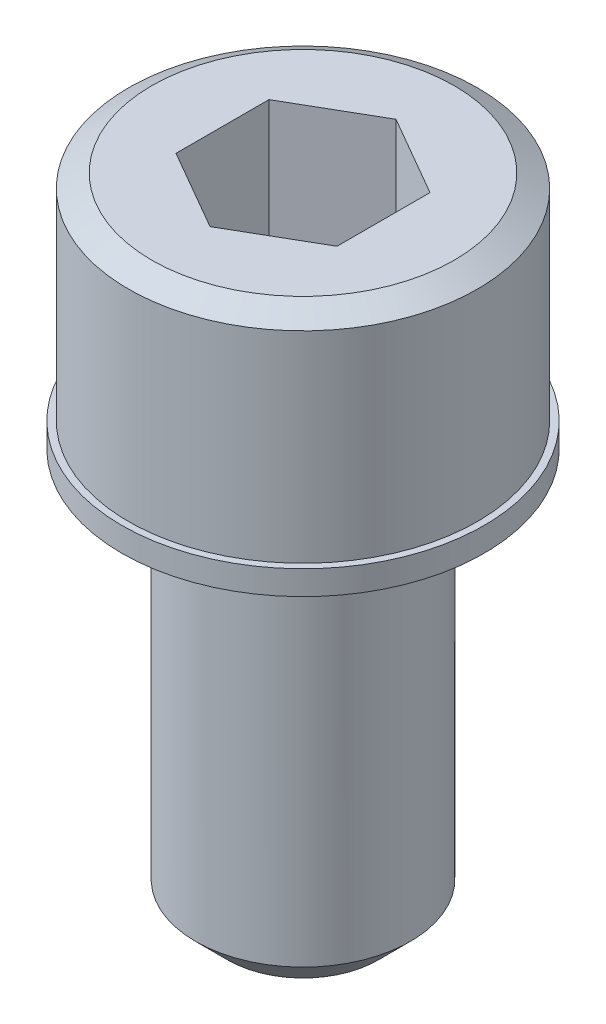
ISO-10303-21;
HEADER;
FILE_DESCRIPTION(('STEP AP214'),'2;1');
FILE_NAME('part.step','',(''),(''),'','','');
FILE_SCHEMA(('AUTOMOTIVE_DESIGN { 1 0 10303 214 1 1 1 1 }'));
ENDSEC;
DATA;
#1=APPLICATION_CONTEXT('core data for automotive mechanical design processes');
#2=APPLICATION_PROTOCOL_DEFINITION('international standard','automotive_design',2000,#1);
#3=PRODUCT_CONTEXT('',#1,'mechanical');
#4=PRODUCT('Part','Part','',(#3));
#5=PRODUCT_RELATED_PRODUCT_CATEGORY('part','',(#4));
#6=PRODUCT_DEFINITION_FORMATION('','',#4);
#7=PRODUCT_DEFINITION_CONTEXT('part definition',#1,'design');
#8=PRODUCT_DEFINITION('design','',#6,#7);
#9=PRODUCT_DEFINITION_SHAPE('','',#8);
#10=(LENGTH_UNIT() NAMED_UNIT(*) SI_UNIT(.MILLI.,.METRE.));
#11=(NAMED_UNIT(*) PLANE_ANGLE_UNIT() SI_UNIT($,.RADIAN.));
#12=(NAMED_UNIT(*) SI_UNIT($,.STERADIAN.) SOLID_ANGLE_UNIT());
#13=UNCERTAINTY_MEASURE_WITH_UNIT(LENGTH_MEASURE(1.E-05),#10,'distance_accuracy_value','');
#14=(GEOMETRIC_REPRESENTATION_CONTEXT(3) GLOBAL_UNCERTAINTY_ASSIGNED_CONTEXT((#13)) GLOBAL_UNIT_ASSIGNED_CONTEXT((#10,
#11,#12)) REPRESENTATION_CONTEXT('',''));
#15=CARTESIAN_POINT('',(0.,0.,0.));
#16=DIRECTION('',(0.,0.,1.));
#17=DIRECTION('',(1.,0.,0.));
#18=AXIS2_PLACEMENT_3D('',#15,#16,#17);
#19=CARTESIAN_POINT('',(0.,2.,0.));
#20=DIRECTION('',(0.,1.,0.));
#21=DIRECTION('',(0.,0.,1.));
#22=AXIS2_PLACEMENT_3D('',#19,#20,#21);
#23=PLANE('',#22);
#24=DIRECTION('',(0.866025403784429,0.,0.500000000000017));
#25=VECTOR('',#24,1.);
#26=CARTESIAN_POINT('',(-3.,2.,1.732050807569));
#27=LINE('',#26,#25);
#28=CARTESIAN_POINT('',(-3.,2.,1.732050807569));
#29=VERTEX_POINT('',#28);
#30=CARTESIAN_POINT('',(0.,2.,3.46410161513799));
#31=VERTEX_POINT('',#30);
#32=EDGE_CURVE('E80',#29,#31,#27,.T.);
#33=ORIENTED_EDGE('',*,*,#32,.T.);
#34=DIRECTION('',(0.866025403784429,0.,-0.500000000000017));
#35=VECTOR('',#34,1.);
#36=CARTESIAN_POINT('',(0.,2.,3.464101615138));
#37=LINE('',#36,#35);
#38=CARTESIAN_POINT('',(3.,2.,1.73205080756902));
#39=VERTEX_POINT('',#38);
#40=EDGE_CURVE('E77',#31,#39,#37,.T.);
#41=ORIENTED_EDGE('',*,*,#40,.T.);
#42=DIRECTION('',(0.,0.,-1.));
#43=VECTOR('',#42,1.);
#44=CARTESIAN_POINT('',(3.,2.,1.732050807569));
#45=LINE('',#44,#43);
#46=CARTESIAN_POINT('',(3.,2.,-1.732050807569));
#47=VERTEX_POINT('',#46);
#48=EDGE_CURVE('E74',#39,#47,#45,.T.);
#49=ORIENTED_EDGE('',*,*,#48,.T.);
#50=DIRECTION('',(-0.866025403784429,0.,-0.500000000000017));
#51=VECTOR('',#50,1.);
#52=CARTESIAN_POINT('',(3.,2.,-1.732050807569));
#53=LINE('',#52,#51);
#54=CARTESIAN_POINT('',(0.,2.,-3.46410161513798));
#55=VERTEX_POINT('',#54);
#56=EDGE_CURVE('E97',#47,#55,#53,.T.);
#57=ORIENTED_EDGE('',*,*,#56,.T.);
#58=DIRECTION('',(-0.866025403784429,0.,0.500000000000017));
#59=VECTOR('',#58,1.);
#60=CARTESIAN_POINT('',(0.,2.,-3.464101615138));
#61=LINE('',#60,#59);
#62=CARTESIAN_POINT('',(-3.,2.,-1.73205080756902));
#63=VERTEX_POINT('',#62);
#64=EDGE_CURVE('E358',#55,#63,#61,.T.);
#65=ORIENTED_EDGE('',*,*,#64,.T.);
#66=DIRECTION('',(0.,0.,1.));
#67=VECTOR('',#66,1.);
#68=CARTESIAN_POINT('',(-3.,2.,-1.732050807569));
#69=LINE('',#68,#67);
#70=EDGE_CURVE('E365',#63,#29,#69,.T.);
#71=ORIENTED_EDGE('',*,*,#70,.T.);
#72=EDGE_LOOP('',(#33,#41,#49,#57,#65,#71));
#73=FACE_BOUND('',#72,.T.);
#74=ADVANCED_FACE('F16',(#73),#23,.T.);
#75=CARTESIAN_POINT('',(0.,8.,3.464101615138));
#76=DIRECTION('',(0.500000000000017,0.,0.866025403784429));
#77=DIRECTION('',(0.866025403784429,0.,-0.500000000000017));
#78=AXIS2_PLACEMENT_3D('',#75,#76,#77);
#79=PLANE('',#78);
#80=ORIENTED_EDGE('',*,*,#40,.F.);
#81=DIRECTION('',(0.,1.,0.));
#82=VECTOR('',#81,1.);
#83=CARTESIAN_POINT('',(0.,8.,3.46410161513797));
#84=LINE('',#83,#82);
#85=CARTESIAN_POINT('',(0.,8.,3.46410161513799));
#86=VERTEX_POINT('',#85);
#87=EDGE_CURVE('E371',#31,#86,#84,.T.);
#88=ORIENTED_EDGE('',*,*,#87,.T.);
#89=DIRECTION('',(0.866025403784423,0.,-0.500000000000027));
#90=VECTOR('',#89,1.);
#91=CARTESIAN_POINT('',(0.,8.,3.464101615138));
#92=LINE('',#91,#90);
#93=CARTESIAN_POINT('',(3.,8.,1.73205080756902));
#94=VERTEX_POINT('',#93);
#95=EDGE_CURVE('E88',#86,#94,#92,.T.);
#96=ORIENTED_EDGE('',*,*,#95,.T.);
#97=DIRECTION('',(0.,1.,0.));
#98=VECTOR('',#97,1.);
#99=CARTESIAN_POINT('',(3.,8.,1.732050807569));
#100=LINE('',#99,#98);
#101=EDGE_CURVE('E83',#94,#39,#100,.F.);
#102=ORIENTED_EDGE('',*,*,#101,.T.);
#103=EDGE_LOOP('',(#80,#88,#96,#102));
#104=FACE_BOUND('',#103,.T.);
#105=ADVANCED_FACE('F86',(#104),#79,.F.);
#106=CARTESIAN_POINT('',(3.,8.,1.732050807569));
#107=DIRECTION('',(1.,0.,0.));
#108=DIRECTION('',(0.,0.,-1.));
#109=AXIS2_PLACEMENT_3D('',#106,#107,#108);
#110=PLANE('',#109);
#111=ORIENTED_EDGE('',*,*,#48,.F.);
#112=ORIENTED_EDGE('',*,*,#101,.F.);
#113=DIRECTION('',(0.,0.,-1.));
#114=VECTOR('',#113,1.);
#115=CARTESIAN_POINT('',(3.,8.,0.));
#116=LINE('',#115,#114);
#117=CARTESIAN_POINT('',(3.,8.,-1.732050807569));
#118=VERTEX_POINT('',#117);
#119=EDGE_CURVE('E374',#94,#118,#116,.T.);
#120=ORIENTED_EDGE('',*,*,#119,.T.);
#121=DIRECTION('',(0.,1.,0.));
#122=VECTOR('',#121,1.);
#123=CARTESIAN_POINT('',(3.,8.,-1.732050807569));
#124=LINE('',#123,#122);
#125=EDGE_CURVE('E94',#118,#47,#124,.F.);
#126=ORIENTED_EDGE('',*,*,#125,.T.);
#127=EDGE_LOOP('',(#111,#112,#120,#126));
#128=FACE_BOUND('',#127,.T.);
#129=ADVANCED_FACE('F92',(#128),#110,.F.);
#130=CARTESIAN_POINT('',(3.,8.,-1.732050807569));
#131=DIRECTION('',(0.500000000000017,0.,-0.866025403784429));
#132=DIRECTION('',(-0.866025403784429,0.,-0.500000000000017));
#133=AXIS2_PLACEMENT_3D('',#130,#131,#132);
#134=PLANE('',#133);
#135=ORIENTED_EDGE('',*,*,#56,.F.);
#136=ORIENTED_EDGE('',*,*,#125,.F.);
#137=DIRECTION('',(-0.866025403784423,0.,-0.500000000000027));
#138=VECTOR('',#137,1.);
#139=CARTESIAN_POINT('',(3.,8.,-1.732050807569));
#140=LINE('',#139,#138);
#141=CARTESIAN_POINT('',(0.,8.,-3.46410161513798));
#142=VERTEX_POINT('',#141);
#143=EDGE_CURVE('E376',#118,#142,#140,.T.);
#144=ORIENTED_EDGE('',*,*,#143,.T.);
#145=DIRECTION('',(0.,1.,0.));
#146=VECTOR('',#145,1.);
#147=CARTESIAN_POINT('',(0.,8.,-3.464101615138));
#148=LINE('',#147,#146);
#149=EDGE_CURVE('E356',#142,#55,#148,.F.);
#150=ORIENTED_EDGE('',*,*,#149,.T.);
#151=EDGE_LOOP('',(#135,#136,#144,#150));
#152=FACE_BOUND('',#151,.T.);
#153=ADVANCED_FACE('F299',(#152),#134,.F.);
#154=CARTESIAN_POINT('',(0.,8.,-3.464101615138));
#155=DIRECTION('',(-0.500000000000017,0.,-0.866025403784429));
#156=DIRECTION('',(-0.866025403784429,0.,0.500000000000017));
#157=AXIS2_PLACEMENT_3D('',#154,#155,#156);
#158=PLANE('',#157);
#159=ORIENTED_EDGE('',*,*,#64,.F.);
#160=ORIENTED_EDGE('',*,*,#149,.F.);
#161=DIRECTION('',(-0.866025403784423,0.,0.500000000000027));
#162=VECTOR('',#161,1.);
#163=CARTESIAN_POINT('',(0.,8.,-3.464101615138));
#164=LINE('',#163,#162);
#165=CARTESIAN_POINT('',(-3.,8.,-1.73205080756902));
#166=VERTEX_POINT('',#165);
#167=EDGE_CURVE('E378',#142,#166,#164,.T.);
#168=ORIENTED_EDGE('',*,*,#167,.T.);
#169=DIRECTION('',(0.,1.,0.));
#170=VECTOR('',#169,1.);
#171=CARTESIAN_POINT('',(-3.,8.,-1.732050807569));
#172=LINE('',#171,#170);
#173=EDGE_CURVE('E362',#166,#63,#172,.F.);
#174=ORIENTED_EDGE('',*,*,#173,.T.);
#175=EDGE_LOOP('',(#159,#160,#168,#174));
#176=FACE_BOUND('',#175,.T.);
#177=ADVANCED_FACE('F290',(#176),#158,.F.);
#178=CARTESIAN_POINT('',(-3.,8.,-1.732050807569));
#179=DIRECTION('',(-1.,0.,0.));
#180=DIRECTION('',(0.,0.,1.));
#181=AXIS2_PLACEMENT_3D('',#178,#179,#180);
#182=PLANE('',#181);
#183=ORIENTED_EDGE('',*,*,#70,.F.);
#184=ORIENTED_EDGE('',*,*,#173,.F.);
#185=DIRECTION('',(0.,0.,-1.));
#186=VECTOR('',#185,1.);
#187=CARTESIAN_POINT('',(-3.,8.,0.));
#188=LINE('',#187,#186);
#189=CARTESIAN_POINT('',(-3.,8.,1.732050807569));
#190=VERTEX_POINT('',#189);
#191=EDGE_CURVE('E380',#166,#190,#188,.F.);
#192=ORIENTED_EDGE('',*,*,#191,.T.);
#193=DIRECTION('',(0.,1.,0.));
#194=VECTOR('',#193,1.);
#195=CARTESIAN_POINT('',(-3.,8.,1.732050807569));
#196=LINE('',#195,#194);
#197=EDGE_CURVE('E367',#190,#29,#196,.F.);
#198=ORIENTED_EDGE('',*,*,#197,.T.);
#199=EDGE_LOOP('',(#183,#184,#192,#198));
#200=FACE_BOUND('',#199,.T.);
#201=ADVANCED_FACE('F281',(#200),#182,.F.);
#202=CARTESIAN_POINT('',(-3.,8.,1.732050807569));
#203=DIRECTION('',(-0.500000000000017,0.,0.866025403784429));
#204=DIRECTION('',(0.866025403784429,0.,0.500000000000017));
#205=AXIS2_PLACEMENT_3D('',#202,#203,#204);
#206=PLANE('',#205);
#207=ORIENTED_EDGE('',*,*,#32,.F.);
#208=ORIENTED_EDGE('',*,*,#197,.F.);
#209=DIRECTION('',(0.866025403784423,0.,0.500000000000027));
#210=VECTOR('',#209,1.);
#211=CARTESIAN_POINT('',(-3.,8.,1.732050807569));
#212=LINE('',#211,#210);
#213=EDGE_CURVE('E123',#190,#86,#212,.T.);
#214=ORIENTED_EDGE('',*,*,#213,.T.);
#215=ORIENTED_EDGE('',*,*,#87,.F.);
#216=EDGE_LOOP('',(#207,#208,#214,#215));
#217=FACE_BOUND('',#216,.T.);
#218=ADVANCED_FACE('F272',(#217),#206,.F.);
#219=CARTESIAN_POINT('',(0.,8.,0.));
#220=DIRECTION('',(0.,-1.,0.));
#221=DIRECTION('',(0.,0.,-1.));
#222=AXIS2_PLACEMENT_3D('',#219,#220,#221);
#223=PLANE('',#222);
#224=ORIENTED_EDGE('',*,*,#191,.F.);
#225=ORIENTED_EDGE('',*,*,#167,.F.);
#226=ORIENTED_EDGE('',*,*,#143,.F.);
#227=ORIENTED_EDGE('',*,*,#119,.F.);
#228=ORIENTED_EDGE('',*,*,#95,.F.);
#229=ORIENTED_EDGE('',*,*,#213,.F.);
#230=EDGE_LOOP('',(#224,#225,#226,#227,#228,#229));
#231=FACE_BOUND('',#230,.T.);
#232=CARTESIAN_POINT('',(0.,7.99999999998136,0.));
#233=DIRECTION('',(0.,-1.,0.));
#234=DIRECTION('',(0.,0.,-1.));
#235=AXIS2_PLACEMENT_3D('',#232,#233,#234);
#236=CIRCLE('',#235,5.63397459615089);
#237=CARTESIAN_POINT('',(0.,7.99999999998136,-5.63397459615089));
#238=VERTEX_POINT('',#237);
#239=EDGE_CURVE('E121',#238,#238,#236,.T.);
#240=ORIENTED_EDGE('',*,*,#239,.F.);
#241=EDGE_LOOP('',(#240));
#242=FACE_BOUND('',#241,.T.);
#243=ADVANCED_FACE('F263',(#231,#242),#223,.F.);
#244=CARTESIAN_POINT('',(0.,7.49999999993634,0.));
#245=DIRECTION('',(0.,-1.,0.));
#246=DIRECTION('',(0.,0.,-1.));
#247=AXIS2_PLACEMENT_3D('',#244,#245,#246);
#248=CONICAL_SURFACE('',#247,6.50000000001683,1.04719755119836);
#249=ORIENTED_EDGE('',*,*,#239,.T.);
#250=EDGE_LOOP('',(#249));
#251=FACE_BOUND('',#250,.T.);
#252=CARTESIAN_POINT('',(0.,7.5,0.));
#253=DIRECTION('',(0.,-1.,0.));
#254=DIRECTION('',(0.,0.,-1.));
#255=AXIS2_PLACEMENT_3D('',#252,#253,#254);
#256=CIRCLE('',#255,6.5);
#257=CARTESIAN_POINT('',(0.,7.5,-6.5));
#258=VERTEX_POINT('',#257);
#259=EDGE_CURVE('E120',#258,#258,#256,.T.);
#260=ORIENTED_EDGE('',*,*,#259,.F.);
#261=EDGE_LOOP('',(#260));
#262=FACE_BOUND('',#261,.T.);
#263=ADVANCED_FACE('F254',(#251,#262),#248,.T.);
#264=CARTESIAN_POINT('',(0.,9.2,0.));
#265=DIRECTION('',(0.,-1.,0.));
#266=DIRECTION('',(0.,0.,-1.));
#267=AXIS2_PLACEMENT_3D('',#264,#265,#266);
#268=CYLINDRICAL_SURFACE('',#267,6.5);
#269=ORIENTED_EDGE('',*,*,#259,.T.);
#270=EDGE_LOOP('',(#269));
#271=FACE_BOUND('',#270,.T.);
#272=CARTESIAN_POINT('',(0.,0.,0.));
#273=DIRECTION('',(0.,-1.,0.));
#274=DIRECTION('',(0.,0.,-1.));
#275=AXIS2_PLACEMENT_3D('',#272,#273,#274);
#276=CIRCLE('',#275,6.5);
#277=CARTESIAN_POINT('',(0.,0.,-6.5));
#278=VERTEX_POINT('',#277);
#279=EDGE_CURVE('E117',#278,#278,#276,.F.);
#280=ORIENTED_EDGE('',*,*,#279,.T.);
#281=EDGE_LOOP('',(#280));
#282=FACE_BOUND('',#281,.T.);
#283=ADVANCED_FACE('F245',(#271,#282),#268,.T.);
#284=CARTESIAN_POINT('',(0.,0.,0.));
#285=DIRECTION('',(0.,-1.,0.));
#286=DIRECTION('',(0.,0.,-1.));
#287=AXIS2_PLACEMENT_3D('',#284,#285,#286);
#288=PLANE('',#287);
#289=ORIENTED_EDGE('',*,*,#279,.F.);
#290=EDGE_LOOP('',(#289));
#291=FACE_BOUND('',#290,.T.);
#292=CARTESIAN_POINT('',(0.,0.,0.));
#293=DIRECTION('',(0.,-1.,0.));
#294=DIRECTION('',(0.,0.,-1.));
#295=AXIS2_PLACEMENT_3D('',#292,#293,#294);
#296=CIRCLE('',#295,6.75);
#297=CARTESIAN_POINT('',(0.,0.,-6.75));
#298=VERTEX_POINT('',#297);
#299=EDGE_CURVE('E114',#298,#298,#296,.T.);
#300=ORIENTED_EDGE('',*,*,#299,.F.);
#301=EDGE_LOOP('',(#300));
#302=FACE_BOUND('',#301,.T.);
#303=ADVANCED_FACE('F236',(#291,#302),#288,.F.);
#304=CARTESIAN_POINT('',(0.,0.,0.));
#305=DIRECTION('',(0.,-1.,0.));
#306=DIRECTION('',(0.,0.,-1.));
#307=AXIS2_PLACEMENT_3D('',#304,#305,#306);
#308=CYLINDRICAL_SURFACE('',#307,6.75);
#309=CARTESIAN_POINT('',(0.,-0.9,0.));
#310=DIRECTION('',(0.,-1.,0.));
#311=DIRECTION('',(0.,0.,-1.));
#312=AXIS2_PLACEMENT_3D('',#309,#310,#311);
#313=CIRCLE('',#312,6.75);
#314=CARTESIAN_POINT('',(0.,-0.9,-6.75));
#315=VERTEX_POINT('',#314);
#316=EDGE_CURVE('E111',#315,#315,#313,.T.);
#317=ORIENTED_EDGE('',*,*,#316,.F.);
#318=EDGE_LOOP('',(#317));
#319=FACE_BOUND('',#318,.T.);
#320=ORIENTED_EDGE('',*,*,#299,.T.);
#321=EDGE_LOOP('',(#320));
#322=FACE_BOUND('',#321,.T.);
#323=ADVANCED_FACE('F228',(#319,#322),#308,.T.);
#324=CARTESIAN_POINT('',(0.,-0.9,0.));
#325=DIRECTION('',(0.,-1.,0.));
#326=DIRECTION('',(0.,0.,-1.));
#327=AXIS2_PLACEMENT_3D('',#324,#325,#326);
#328=PLANE('',#327);
#329=CARTESIAN_POINT('',(0.,-0.9,0.));
#330=DIRECTION('',(0.,-1.,0.));
#331=DIRECTION('',(0.,0.,-1.));
#332=AXIS2_PLACEMENT_3D('',#329,#330,#331);
#333=CIRCLE('',#332,4.2);
#334=CARTESIAN_POINT('',(0.,-0.9,-4.2));
#335=VERTEX_POINT('',#334);
#336=EDGE_CURVE('E108',#335,#335,#333,.F.);
#337=ORIENTED_EDGE('',*,*,#336,.T.);
#338=EDGE_LOOP('',(#337));
#339=FACE_BOUND('',#338,.T.);
#340=ORIENTED_EDGE('',*,*,#316,.T.);
#341=EDGE_LOOP('',(#340));
#342=FACE_BOUND('',#341,.T.);
#343=ADVANCED_FACE('F220',(#339,#342),#328,.T.);
#344=CARTESIAN_POINT('',(0.,0.,0.));
#345=DIRECTION('',(0.,-1.,0.));
#346=DIRECTION('',(0.,0.,-1.));
#347=AXIS2_PLACEMENT_3D('',#344,#345,#346);
#348=CYLINDRICAL_SURFACE('',#347,4.2);
#349=ORIENTED_EDGE('',*,*,#336,.F.);
#350=EDGE_LOOP('',(#349));
#351=FACE_BOUND('',#350,.T.);
#352=CARTESIAN_POINT('',(0.,0.,0.));
#353=DIRECTION('',(0.,-1.,0.));
#354=DIRECTION('',(0.,0.,-1.));
#355=AXIS2_PLACEMENT_3D('',#352,#353,#354);
#356=CIRCLE('',#355,4.2);
#357=CARTESIAN_POINT('',(0.,0.,-4.2));
#358=VERTEX_POINT('',#357);
#359=EDGE_CURVE('E105',#358,#358,#356,.T.);
#360=ORIENTED_EDGE('',*,*,#359,.F.);
#361=EDGE_LOOP('',(#360));
#362=FACE_BOUND('',#361,.T.);
#363=ADVANCED_FACE('F146',(#351,#362),#348,.F.);
#364=CARTESIAN_POINT('',(0.,0.,0.));
#365=DIRECTION('',(0.,-1.,0.));
#366=DIRECTION('',(0.,0.,-1.));
#367=AXIS2_PLACEMENT_3D('',#364,#365,#366);
#368=PLANE('',#367);
#369=CARTESIAN_POINT('',(0.,0.,0.));
#370=DIRECTION('',(0.,-1.,0.));
#371=DIRECTION('',(1.,0.,0.));
#372=AXIS2_PLACEMENT_3D('',#369,#370,#371);
#373=CIRCLE('',#372,4.1);
#374=CARTESIAN_POINT('',(-4.1,0.,0.));
#375=VERTEX_POINT('',#374);
#376=CARTESIAN_POINT('',(4.1,0.,0.));
#377=VERTEX_POINT('',#376);
#378=EDGE_CURVE('E104',#375,#377,#373,.F.);
#379=ORIENTED_EDGE('',*,*,#378,.T.);
#380=CARTESIAN_POINT('',(0.,0.,0.));
#381=DIRECTION('',(0.,-1.,0.));
#382=DIRECTION('',(-1.,0.,0.));
#383=AXIS2_PLACEMENT_3D('',#380,#381,#382);
#384=CIRCLE('',#383,4.1);
#385=EDGE_CURVE('E35',#377,#375,#384,.F.);
#386=ORIENTED_EDGE('',*,*,#385,.T.);
#387=EDGE_LOOP('',(#379,#386));
#388=FACE_BOUND('',#387,.T.);
#389=ORIENTED_EDGE('',*,*,#359,.T.);
#390=EDGE_LOOP('',(#389));
#391=FACE_BOUND('',#390,.T.);
#392=ADVANCED_FACE('F128',(#388,#391),#368,.T.);
#393=CARTESIAN_POINT('',(0.,-16.,0.));
#394=DIRECTION('',(0.,-1.,0.));
#395=DIRECTION('',(0.,0.,-1.));
#396=AXIS2_PLACEMENT_3D('',#393,#394,#395);
#397=PLANE('',#396);
#398=CARTESIAN_POINT('',(0.,-15.9999999999058,0.));
#399=DIRECTION('',(0.,1.,0.));
#400=DIRECTION('',(0.,0.,1.));
#401=AXIS2_PLACEMENT_3D('',#398,#399,#400);
#402=CIRCLE('',#401,2.8000000000361);
#403=CARTESIAN_POINT('',(0.,-15.9999999999058,2.8000000000361));
#404=VERTEX_POINT('',#403);
#405=EDGE_CURVE('E101',#404,#404,#402,.T.);
#406=ORIENTED_EDGE('',*,*,#405,.F.);
#407=EDGE_LOOP('',(#406));
#408=FACE_BOUND('',#407,.T.);
#409=ADVANCED_FACE('F145',(#408),#397,.T.);
#410=CARTESIAN_POINT('',(0.,-0.1,0.));
#411=DIRECTION('',(0.,-1.,0.));
#412=DIRECTION('',(-1.,0.,0.));
#413=AXIS2_PLACEMENT_3D('',#410,#411,#412);
#414=TOROIDAL_SURFACE('',#413,4.1,0.1);
#415=CARTESIAN_POINT('',(0.,-0.1,0.));
#416=DIRECTION('',(0.,-1.,0.));
#417=DIRECTION('',(0.,0.,-1.));
#418=AXIS2_PLACEMENT_3D('',#415,#416,#417);
#419=CIRCLE('',#418,4.);
#420=CARTESIAN_POINT('',(0.,-0.1,-4.));
#421=VERTEX_POINT('',#420);
#422=EDGE_CURVE('E27',#421,#421,#419,.T.);
#423=ORIENTED_EDGE('',*,*,#422,.F.);
#424=EDGE_LOOP('',(#423));
#425=FACE_BOUND('',#424,.T.);
#426=ORIENTED_EDGE('',*,*,#378,.F.);
#427=ORIENTED_EDGE('',*,*,#385,.F.);
#428=EDGE_LOOP('',(#426,#427));
#429=FACE_BOUND('',#428,.T.);
#430=ADVANCED_FACE('F125',(#425,#429),#414,.F.);
#431=CARTESIAN_POINT('',(0.,-14.8000000000934,0.));
#432=DIRECTION('',(0.,1.,0.));
#433=DIRECTION('',(0.,0.,1.));
#434=AXIS2_PLACEMENT_3D('',#431,#432,#433);
#435=CONICAL_SURFACE('',#434,3.99999999990542,0.785398163421133);
#436=ORIENTED_EDGE('',*,*,#405,.T.);
#437=EDGE_LOOP('',(#436));
#438=FACE_BOUND('',#437,.T.);
#439=CARTESIAN_POINT('',(0.,-14.8,0.));
#440=DIRECTION('',(0.,-1.,0.));
#441=DIRECTION('',(0.,0.,-1.));
#442=AXIS2_PLACEMENT_3D('',#439,#440,#441);
#443=CIRCLE('',#442,4.);
#444=CARTESIAN_POINT('',(0.,-14.8,-4.));
#445=VERTEX_POINT('',#444);
#446=EDGE_CURVE('E11',#445,#445,#443,.F.);
#447=ORIENTED_EDGE('',*,*,#446,.F.);
#448=EDGE_LOOP('',(#447));
#449=FACE_BOUND('',#448,.T.);
#450=ADVANCED_FACE('F169',(#438,#449),#435,.T.);
#451=CARTESIAN_POINT('',(0.,9.2,0.));
#452=DIRECTION('',(0.,-1.,0.));
#453=DIRECTION('',(0.,0.,-1.));
#454=AXIS2_PLACEMENT_3D('',#451,#452,#453);
#455=CYLINDRICAL_SURFACE('',#454,4.);
#456=ORIENTED_EDGE('',*,*,#446,.T.);
#457=EDGE_LOOP('',(#456));
#458=FACE_BOUND('',#457,.T.);
#459=ORIENTED_EDGE('',*,*,#422,.T.);
#460=EDGE_LOOP('',(#459));
#461=FACE_BOUND('',#460,.T.);
#462=ADVANCED_FACE('F175',(#458,#461),#455,.T.);
#463=CLOSED_SHELL('',(#74,#105,#129,#153,#177,#201,#218,#243,#263,#283,#303,#323,#343,#363,#392,
#409,#430,#450,#462));
#464=MANIFOLD_SOLID_BREP('B1',#463);
#465=ADVANCED_BREP_SHAPE_REPRESENTATION('',(#18,#464),#14);
#466=SHAPE_DEFINITION_REPRESENTATION(#9,#465);
ENDSEC;
END-ISO-10303-21;
